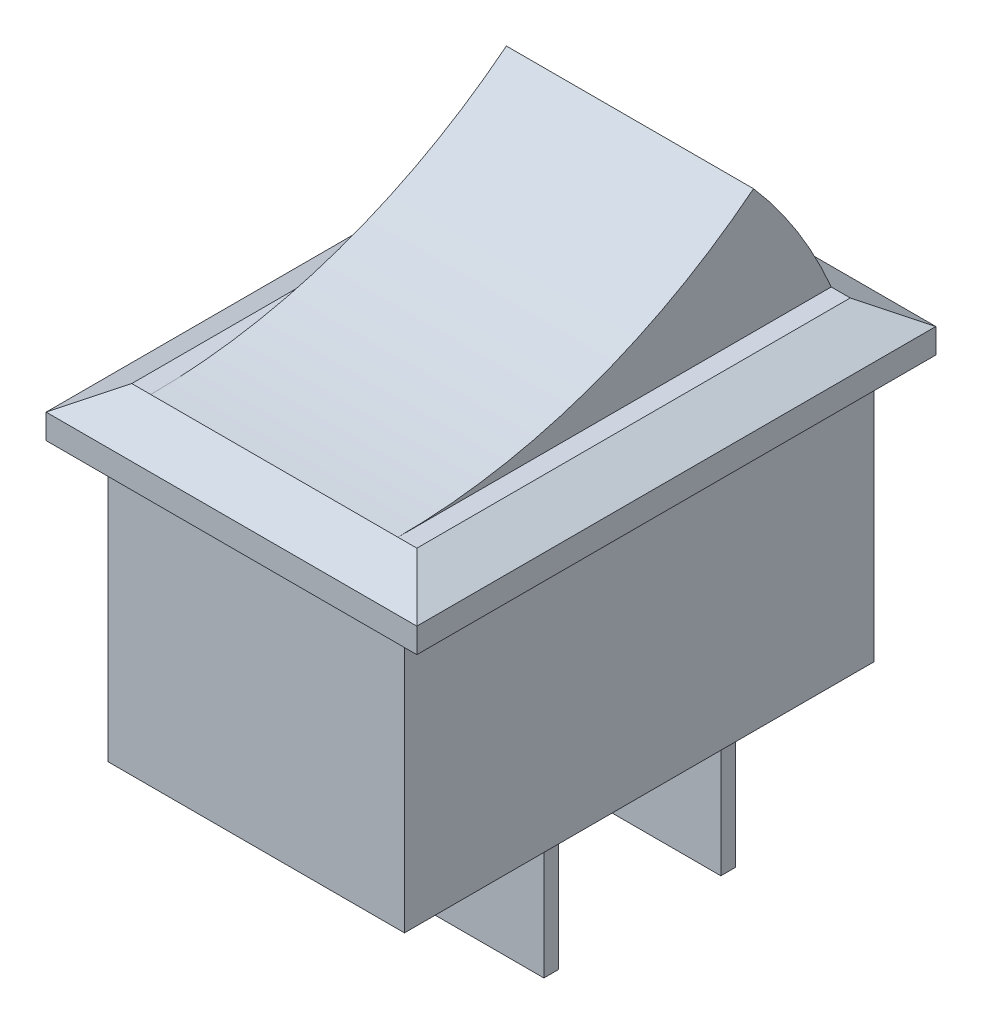
ISO-10303-21;
HEADER;
FILE_DESCRIPTION(('STEP AP214'),'2;1');
FILE_NAME('part.step','',(''),(''),'','','');
FILE_SCHEMA(('AUTOMOTIVE_DESIGN { 1 0 10303 214 1 1 1 1 }'));
ENDSEC;
DATA;
#1=APPLICATION_CONTEXT('core data for automotive mechanical design processes');
#2=APPLICATION_PROTOCOL_DEFINITION('international standard','automotive_design',2000,#1);
#3=PRODUCT_CONTEXT('',#1,'mechanical');
#4=PRODUCT('Part','Part','',(#3));
#5=PRODUCT_RELATED_PRODUCT_CATEGORY('part','',(#4));
#6=PRODUCT_DEFINITION_FORMATION('','',#4);
#7=PRODUCT_DEFINITION_CONTEXT('part definition',#1,'design');
#8=PRODUCT_DEFINITION('design','',#6,#7);
#9=PRODUCT_DEFINITION_SHAPE('','',#8);
#10=(LENGTH_UNIT() NAMED_UNIT(*) SI_UNIT(.MILLI.,.METRE.));
#11=(NAMED_UNIT(*) PLANE_ANGLE_UNIT() SI_UNIT($,.RADIAN.));
#12=(NAMED_UNIT(*) SI_UNIT($,.STERADIAN.) SOLID_ANGLE_UNIT());
#13=UNCERTAINTY_MEASURE_WITH_UNIT(LENGTH_MEASURE(1.E-05),#10,'distance_accuracy_value','');
#14=(GEOMETRIC_REPRESENTATION_CONTEXT(3) GLOBAL_UNCERTAINTY_ASSIGNED_CONTEXT((#13)) GLOBAL_UNIT_ASSIGNED_CONTEXT((#10,
#11,#12)) REPRESENTATION_CONTEXT('',''));
#15=CARTESIAN_POINT('',(0.,0.,0.));
#16=DIRECTION('',(0.,0.,1.));
#17=DIRECTION('',(1.,0.,0.));
#18=AXIS2_PLACEMENT_3D('',#15,#16,#17);
#19=CARTESIAN_POINT('',(0.,0.,0.));
#20=DIRECTION('',(0.,-1.,0.));
#21=DIRECTION('',(0.,0.,-1.));
#22=AXIS2_PLACEMENT_3D('',#19,#20,#21);
#23=PLANE('',#22);
#24=DIRECTION('',(0.,0.,-1.));
#25=VECTOR('',#24,1.);
#26=CARTESIAN_POINT('',(6.,0.,9.5));
#27=LINE('',#26,#25);
#28=CARTESIAN_POINT('',(6.,0.,9.5));
#29=VERTEX_POINT('',#28);
#30=CARTESIAN_POINT('',(6.,0.,-9.5));
#31=VERTEX_POINT('',#30);
#32=EDGE_CURVE('E330',#29,#31,#27,.T.);
#33=ORIENTED_EDGE('',*,*,#32,.F.);
#34=DIRECTION('',(1.,0.,0.));
#35=VECTOR('',#34,1.);
#36=CARTESIAN_POINT('',(-6.,0.,9.5));
#37=LINE('',#36,#35);
#38=CARTESIAN_POINT('',(-6.,0.,9.5));
#39=VERTEX_POINT('',#38);
#40=EDGE_CURVE('E335',#39,#29,#37,.T.);
#41=ORIENTED_EDGE('',*,*,#40,.F.);
#42=DIRECTION('',(0.,0.,1.));
#43=VECTOR('',#42,1.);
#44=CARTESIAN_POINT('',(-6.,0.,9.5));
#45=LINE('',#44,#43);
#46=CARTESIAN_POINT('',(-6.,0.,-9.5));
#47=VERTEX_POINT('',#46);
#48=EDGE_CURVE('E349',#47,#39,#45,.T.);
#49=ORIENTED_EDGE('',*,*,#48,.F.);
#50=DIRECTION('',(-1.,0.,0.));
#51=VECTOR('',#50,1.);
#52=CARTESIAN_POINT('',(-6.,0.,-9.5));
#53=LINE('',#52,#51);
#54=EDGE_CURVE('E347',#31,#47,#53,.T.);
#55=ORIENTED_EDGE('',*,*,#54,.F.);
#56=EDGE_LOOP('',(#33,#41,#49,#55));
#57=FACE_BOUND('',#56,.T.);
#58=DIRECTION('',(1.,0.,0.));
#59=VECTOR('',#58,1.);
#60=CARTESIAN_POINT('',(2.4,0.,-7.5));
#61=LINE('',#60,#59);
#62=CARTESIAN_POINT('',(-2.4,0.,-7.5));
#63=VERTEX_POINT('',#62);
#64=CARTESIAN_POINT('',(2.4,0.,-7.5));
#65=VERTEX_POINT('',#64);
#66=EDGE_CURVE('E232',#63,#65,#61,.T.);
#67=ORIENTED_EDGE('',*,*,#66,.F.);
#68=DIRECTION('',(0.,0.,-1.));
#69=VECTOR('',#68,1.);
#70=CARTESIAN_POINT('',(-2.4,0.,-7.5));
#71=LINE('',#70,#69);
#72=CARTESIAN_POINT('',(-2.4,0.,-6.9));
#73=VERTEX_POINT('',#72);
#74=EDGE_CURVE('E229',#73,#63,#71,.T.);
#75=ORIENTED_EDGE('',*,*,#74,.F.);
#76=DIRECTION('',(-1.,0.,0.));
#77=VECTOR('',#76,1.);
#78=CARTESIAN_POINT('',(2.4,0.,-6.9));
#79=LINE('',#78,#77);
#80=CARTESIAN_POINT('',(2.4,0.,-6.9));
#81=VERTEX_POINT('',#80);
#82=EDGE_CURVE('E241',#81,#73,#79,.T.);
#83=ORIENTED_EDGE('',*,*,#82,.F.);
#84=DIRECTION('',(0.,0.,1.));
#85=VECTOR('',#84,1.);
#86=CARTESIAN_POINT('',(2.4,0.,-7.5));
#87=LINE('',#86,#85);
#88=EDGE_CURVE('E249',#65,#81,#87,.T.);
#89=ORIENTED_EDGE('',*,*,#88,.F.);
#90=EDGE_LOOP('',(#67,#75,#83,#89));
#91=FACE_BOUND('',#90,.T.);
#92=DIRECTION('',(1.,0.,0.));
#93=VECTOR('',#92,1.);
#94=CARTESIAN_POINT('',(2.4,0.,-0.340000000000002));
#95=LINE('',#94,#93);
#96=CARTESIAN_POINT('',(-2.4,0.,-0.340000000000002));
#97=VERTEX_POINT('',#96);
#98=CARTESIAN_POINT('',(2.4,0.,-0.340000000000002));
#99=VERTEX_POINT('',#98);
#100=EDGE_CURVE('E786',#97,#99,#95,.T.);
#101=ORIENTED_EDGE('',*,*,#100,.F.);
#102=DIRECTION('',(0.,0.,-1.));
#103=VECTOR('',#102,1.);
#104=CARTESIAN_POINT('',(-2.4,0.,-0.340000000000002));
#105=LINE('',#104,#103);
#106=CARTESIAN_POINT('',(-2.4,0.,0.259999999999998));
#107=VERTEX_POINT('',#106);
#108=EDGE_CURVE('E227',#107,#97,#105,.T.);
#109=ORIENTED_EDGE('',*,*,#108,.F.);
#110=DIRECTION('',(-1.,0.,0.));
#111=VECTOR('',#110,1.);
#112=CARTESIAN_POINT('',(2.4,0.,0.259999999999998));
#113=LINE('',#112,#111);
#114=CARTESIAN_POINT('',(2.4,0.,0.259999999999998));
#115=VERTEX_POINT('',#114);
#116=EDGE_CURVE('E223',#115,#107,#113,.T.);
#117=ORIENTED_EDGE('',*,*,#116,.F.);
#118=DIRECTION('',(0.,0.,1.));
#119=VECTOR('',#118,1.);
#120=CARTESIAN_POINT('',(2.4,0.,-0.340000000000002));
#121=LINE('',#120,#119);
#122=EDGE_CURVE('E783',#99,#115,#121,.T.);
#123=ORIENTED_EDGE('',*,*,#122,.F.);
#124=EDGE_LOOP('',(#101,#109,#117,#123));
#125=FACE_BOUND('',#124,.T.);
#126=ADVANCED_FACE('F35',(#57,#91,#125),#23,.T.);
#127=CARTESIAN_POINT('',(0.,13.,0.));
#128=DIRECTION('',(0.,1.,0.));
#129=DIRECTION('',(0.,0.,1.));
#130=AXIS2_PLACEMENT_3D('',#127,#128,#129);
#131=PLANE('',#130);
#132=DIRECTION('',(-1.,0.,0.));
#133=VECTOR('',#132,1.);
#134=CARTESIAN_POINT('',(-7.5,13.,-8.76794919243113));
#135=LINE('',#134,#133);
#136=CARTESIAN_POINT('',(5.76794919243113,13.,-8.76794919243113));
#137=VERTEX_POINT('',#136);
#138=CARTESIAN_POINT('',(5.,13.,-8.76794919243113));
#139=VERTEX_POINT('',#138);
#140=EDGE_CURVE('E372',#137,#139,#135,.T.);
#141=ORIENTED_EDGE('',*,*,#140,.T.);
#142=DIRECTION('',(0.,0.,-1.));
#143=VECTOR('',#142,1.);
#144=CARTESIAN_POINT('',(5.,13.,8.));
#145=LINE('',#144,#143);
#146=CARTESIAN_POINT('',(5.,13.,8.76794919243113));
#147=VERTEX_POINT('',#146);
#148=EDGE_CURVE('E287',#147,#139,#145,.T.);
#149=ORIENTED_EDGE('',*,*,#148,.F.);
#150=DIRECTION('',(1.,0.,0.));
#151=VECTOR('',#150,1.);
#152=CARTESIAN_POINT('',(7.5,13.,8.76794919243113));
#153=LINE('',#152,#151);
#154=CARTESIAN_POINT('',(5.76794919243113,13.,8.76794919243113));
#155=VERTEX_POINT('',#154);
#156=EDGE_CURVE('E365',#147,#155,#153,.T.);
#157=ORIENTED_EDGE('',*,*,#156,.T.);
#158=DIRECTION('',(0.,0.,-1.));
#159=VECTOR('',#158,1.);
#160=CARTESIAN_POINT('',(5.76794919243113,13.,-10.5));
#161=LINE('',#160,#159);
#162=EDGE_CURVE('E363',#155,#137,#161,.T.);
#163=ORIENTED_EDGE('',*,*,#162,.T.);
#164=EDGE_LOOP('',(#141,#149,#157,#163));
#165=FACE_BOUND('',#164,.T.);
#166=ADVANCED_FACE('F449',(#165),#131,.T.);
#167=CARTESIAN_POINT('',(6.,11.,9.5));
#168=DIRECTION('',(-1.,0.,0.));
#169=DIRECTION('',(0.,0.,1.));
#170=AXIS2_PLACEMENT_3D('',#167,#168,#169);
#171=PLANE('',#170);
#172=ORIENTED_EDGE('',*,*,#32,.T.);
#173=DIRECTION('',(0.,-1.,0.));
#174=VECTOR('',#173,1.);
#175=CARTESIAN_POINT('',(6.,11.,-9.5));
#176=LINE('',#175,#174);
#177=CARTESIAN_POINT('',(6.,11.,-9.5));
#178=VERTEX_POINT('',#177);
#179=EDGE_CURVE('E360',#178,#31,#176,.T.);
#180=ORIENTED_EDGE('',*,*,#179,.F.);
#181=DIRECTION('',(0.,0.,-1.));
#182=VECTOR('',#181,1.);
#183=CARTESIAN_POINT('',(6.,11.,9.5));
#184=LINE('',#183,#182);
#185=CARTESIAN_POINT('',(6.,11.,9.5));
#186=VERTEX_POINT('',#185);
#187=EDGE_CURVE('E331',#186,#178,#184,.T.);
#188=ORIENTED_EDGE('',*,*,#187,.F.);
#189=DIRECTION('',(0.,-1.,0.));
#190=VECTOR('',#189,1.);
#191=CARTESIAN_POINT('',(6.,11.,9.5));
#192=LINE('',#191,#190);
#193=EDGE_CURVE('E344',#186,#29,#192,.T.);
#194=ORIENTED_EDGE('',*,*,#193,.T.);
#195=EDGE_LOOP('',(#172,#180,#188,#194));
#196=FACE_BOUND('',#195,.T.);
#197=ADVANCED_FACE('F451',(#196),#171,.F.);
#198=CARTESIAN_POINT('',(-6.,11.,-9.5));
#199=DIRECTION('',(0.,0.,1.));
#200=DIRECTION('',(1.,0.,0.));
#201=AXIS2_PLACEMENT_3D('',#198,#199,#200);
#202=PLANE('',#201);
#203=ORIENTED_EDGE('',*,*,#54,.T.);
#204=DIRECTION('',(0.,-1.,0.));
#205=VECTOR('',#204,1.);
#206=CARTESIAN_POINT('',(-6.,11.,-9.5));
#207=LINE('',#206,#205);
#208=CARTESIAN_POINT('',(-6.,11.,-9.5));
#209=VERTEX_POINT('',#208);
#210=EDGE_CURVE('E357',#209,#47,#207,.T.);
#211=ORIENTED_EDGE('',*,*,#210,.F.);
#212=DIRECTION('',(-1.,0.,0.));
#213=VECTOR('',#212,1.);
#214=CARTESIAN_POINT('',(-6.,11.,-9.5));
#215=LINE('',#214,#213);
#216=EDGE_CURVE('E334',#178,#209,#215,.T.);
#217=ORIENTED_EDGE('',*,*,#216,.F.);
#218=ORIENTED_EDGE('',*,*,#179,.T.);
#219=EDGE_LOOP('',(#203,#211,#217,#218));
#220=FACE_BOUND('',#219,.T.);
#221=ADVANCED_FACE('F457',(#220),#202,.F.);
#222=CARTESIAN_POINT('',(-6.,11.,9.5));
#223=DIRECTION('',(1.,0.,0.));
#224=DIRECTION('',(0.,0.,-1.));
#225=AXIS2_PLACEMENT_3D('',#222,#223,#224);
#226=PLANE('',#225);
#227=ORIENTED_EDGE('',*,*,#48,.T.);
#228=DIRECTION('',(0.,-1.,0.));
#229=VECTOR('',#228,1.);
#230=CARTESIAN_POINT('',(-6.,11.,9.5));
#231=LINE('',#230,#229);
#232=CARTESIAN_POINT('',(-6.,11.,9.5));
#233=VERTEX_POINT('',#232);
#234=EDGE_CURVE('E354',#233,#39,#231,.T.);
#235=ORIENTED_EDGE('',*,*,#234,.F.);
#236=DIRECTION('',(0.,0.,1.));
#237=VECTOR('',#236,1.);
#238=CARTESIAN_POINT('',(-6.,11.,9.5));
#239=LINE('',#238,#237);
#240=EDGE_CURVE('E338',#209,#233,#239,.T.);
#241=ORIENTED_EDGE('',*,*,#240,.F.);
#242=ORIENTED_EDGE('',*,*,#210,.T.);
#243=EDGE_LOOP('',(#227,#235,#241,#242));
#244=FACE_BOUND('',#243,.T.);
#245=ADVANCED_FACE('F474',(#244),#226,.F.);
#246=CARTESIAN_POINT('',(-6.,11.,9.5));
#247=DIRECTION('',(0.,0.,-1.));
#248=DIRECTION('',(-1.,0.,0.));
#249=AXIS2_PLACEMENT_3D('',#246,#247,#248);
#250=PLANE('',#249);
#251=ORIENTED_EDGE('',*,*,#40,.T.);
#252=ORIENTED_EDGE('',*,*,#193,.F.);
#253=DIRECTION('',(1.,0.,0.));
#254=VECTOR('',#253,1.);
#255=CARTESIAN_POINT('',(-6.,11.,9.5));
#256=LINE('',#255,#254);
#257=EDGE_CURVE('E341',#233,#186,#256,.T.);
#258=ORIENTED_EDGE('',*,*,#257,.F.);
#259=ORIENTED_EDGE('',*,*,#234,.T.);
#260=EDGE_LOOP('',(#251,#252,#258,#259));
#261=FACE_BOUND('',#260,.T.);
#262=ADVANCED_FACE('F470',(#261),#250,.F.);
#263=CARTESIAN_POINT('',(0.,11.,0.));
#264=DIRECTION('',(0.,1.,0.));
#265=DIRECTION('',(0.,0.,1.));
#266=AXIS2_PLACEMENT_3D('',#263,#264,#265);
#267=PLANE('',#266);
#268=DIRECTION('',(0.,0.,1.));
#269=VECTOR('',#268,1.);
#270=CARTESIAN_POINT('',(-7.5,11.,10.5));
#271=LINE('',#270,#269);
#272=CARTESIAN_POINT('',(-7.5,11.,-10.5));
#273=VERTEX_POINT('',#272);
#274=CARTESIAN_POINT('',(-7.5,11.,10.5));
#275=VERTEX_POINT('',#274);
#276=EDGE_CURVE('E310',#273,#275,#271,.T.);
#277=ORIENTED_EDGE('',*,*,#276,.F.);
#278=DIRECTION('',(-1.,0.,0.));
#279=VECTOR('',#278,1.);
#280=CARTESIAN_POINT('',(7.5,11.,-10.5));
#281=LINE('',#280,#279);
#282=CARTESIAN_POINT('',(7.5,11.,-10.5));
#283=VERTEX_POINT('',#282);
#284=EDGE_CURVE('E319',#283,#273,#281,.T.);
#285=ORIENTED_EDGE('',*,*,#284,.F.);
#286=DIRECTION('',(0.,0.,-1.));
#287=VECTOR('',#286,1.);
#288=CARTESIAN_POINT('',(7.5,11.,10.5));
#289=LINE('',#288,#287);
#290=CARTESIAN_POINT('',(7.5,11.,10.5));
#291=VERTEX_POINT('',#290);
#292=EDGE_CURVE('E316',#291,#283,#289,.T.);
#293=ORIENTED_EDGE('',*,*,#292,.F.);
#294=DIRECTION('',(1.,0.,0.));
#295=VECTOR('',#294,1.);
#296=CARTESIAN_POINT('',(7.5,11.,10.5));
#297=LINE('',#296,#295);
#298=EDGE_CURVE('E313',#275,#291,#297,.T.);
#299=ORIENTED_EDGE('',*,*,#298,.F.);
#300=EDGE_LOOP('',(#277,#285,#293,#299));
#301=FACE_BOUND('',#300,.T.);
#302=ORIENTED_EDGE('',*,*,#257,.T.);
#303=ORIENTED_EDGE('',*,*,#187,.T.);
#304=ORIENTED_EDGE('',*,*,#216,.T.);
#305=ORIENTED_EDGE('',*,*,#240,.T.);
#306=EDGE_LOOP('',(#302,#303,#304,#305));
#307=FACE_BOUND('',#306,.T.);
#308=ADVANCED_FACE('F415',(#301,#307),#267,.F.);
#309=DIRECTION('',(0.,0.,1.));
#310=VECTOR('',#309,1.);
#311=CARTESIAN_POINT('',(-5.,13.,8.));
#312=LINE('',#311,#310);
#313=CARTESIAN_POINT('',(-5.,13.,-8.76794919243113));
#314=VERTEX_POINT('',#313);
#315=CARTESIAN_POINT('',(-5.,13.,8.76794919243113));
#316=VERTEX_POINT('',#315);
#317=EDGE_CURVE('E285',#314,#316,#312,.T.);
#318=ORIENTED_EDGE('',*,*,#317,.F.);
#319=CARTESIAN_POINT('',(-5.76794919243113,13.,-8.76794919243113));
#320=VERTEX_POINT('',#319);
#321=EDGE_CURVE('E371',#314,#320,#135,.T.);
#322=ORIENTED_EDGE('',*,*,#321,.T.);
#323=DIRECTION('',(0.,0.,1.));
#324=VECTOR('',#323,1.);
#325=CARTESIAN_POINT('',(-5.76794919243113,13.,10.5));
#326=LINE('',#325,#324);
#327=CARTESIAN_POINT('',(-5.76794919243113,13.,8.76794919243113));
#328=VERTEX_POINT('',#327);
#329=EDGE_CURVE('E369',#320,#328,#326,.T.);
#330=ORIENTED_EDGE('',*,*,#329,.T.);
#331=EDGE_CURVE('E366',#328,#316,#153,.T.);
#332=ORIENTED_EDGE('',*,*,#331,.T.);
#333=EDGE_LOOP('',(#318,#322,#330,#332));
#334=FACE_BOUND('',#333,.T.);
#335=ADVANCED_FACE('F433',(#334),#131,.T.);
#336=CARTESIAN_POINT('',(-7.5,13.,10.5));
#337=DIRECTION('',(1.,0.,0.));
#338=DIRECTION('',(0.,0.,-1.));
#339=AXIS2_PLACEMENT_3D('',#336,#337,#338);
#340=PLANE('',#339);
#341=DIRECTION('',(0.,-1.,0.));
#342=VECTOR('',#341,1.);
#343=CARTESIAN_POINT('',(-7.5,13.,10.5));
#344=LINE('',#343,#342);
#345=CARTESIAN_POINT('',(-7.5,12.,10.5));
#346=VERTEX_POINT('',#345);
#347=EDGE_CURVE('E328',#346,#275,#344,.T.);
#348=ORIENTED_EDGE('',*,*,#347,.F.);
#349=DIRECTION('',(0.,0.,-1.));
#350=VECTOR('',#349,1.);
#351=CARTESIAN_POINT('',(-7.5,12.,-10.5));
#352=LINE('',#351,#350);
#353=CARTESIAN_POINT('',(-7.5,12.,-10.5));
#354=VERTEX_POINT('',#353);
#355=EDGE_CURVE('E379',#346,#354,#352,.T.);
#356=ORIENTED_EDGE('',*,*,#355,.T.);
#357=DIRECTION('',(0.,-1.,0.));
#358=VECTOR('',#357,1.);
#359=CARTESIAN_POINT('',(-7.5,13.,-10.5));
#360=LINE('',#359,#358);
#361=EDGE_CURVE('E322',#354,#273,#360,.T.);
#362=ORIENTED_EDGE('',*,*,#361,.T.);
#363=ORIENTED_EDGE('',*,*,#276,.T.);
#364=EDGE_LOOP('',(#348,#356,#362,#363));
#365=FACE_BOUND('',#364,.T.);
#366=ADVANCED_FACE('F410',(#365),#340,.F.);
#367=CARTESIAN_POINT('',(7.5,13.,10.5));
#368=DIRECTION('',(0.,0.,-1.));
#369=DIRECTION('',(-1.,0.,0.));
#370=AXIS2_PLACEMENT_3D('',#367,#368,#369);
#371=PLANE('',#370);
#372=DIRECTION('',(0.,-1.,0.));
#373=VECTOR('',#372,1.);
#374=CARTESIAN_POINT('',(7.5,13.,10.5));
#375=LINE('',#374,#373);
#376=CARTESIAN_POINT('',(7.5,12.,10.5));
#377=VERTEX_POINT('',#376);
#378=EDGE_CURVE('E326',#377,#291,#375,.T.);
#379=ORIENTED_EDGE('',*,*,#378,.F.);
#380=DIRECTION('',(-1.,0.,0.));
#381=VECTOR('',#380,1.);
#382=CARTESIAN_POINT('',(-7.5,12.,10.5));
#383=LINE('',#382,#381);
#384=EDGE_CURVE('E381',#377,#346,#383,.T.);
#385=ORIENTED_EDGE('',*,*,#384,.T.);
#386=ORIENTED_EDGE('',*,*,#347,.T.);
#387=ORIENTED_EDGE('',*,*,#298,.T.);
#388=EDGE_LOOP('',(#379,#385,#386,#387));
#389=FACE_BOUND('',#388,.T.);
#390=ADVANCED_FACE('F407',(#389),#371,.F.);
#391=CARTESIAN_POINT('',(7.5,13.,10.5));
#392=DIRECTION('',(-1.,0.,0.));
#393=DIRECTION('',(0.,0.,1.));
#394=AXIS2_PLACEMENT_3D('',#391,#392,#393);
#395=PLANE('',#394);
#396=DIRECTION('',(0.,-1.,0.));
#397=VECTOR('',#396,1.);
#398=CARTESIAN_POINT('',(7.5,13.,-10.5));
#399=LINE('',#398,#397);
#400=CARTESIAN_POINT('',(7.5,12.,-10.5));
#401=VERTEX_POINT('',#400);
#402=EDGE_CURVE('E324',#401,#283,#399,.T.);
#403=ORIENTED_EDGE('',*,*,#402,.F.);
#404=DIRECTION('',(0.,0.,1.));
#405=VECTOR('',#404,1.);
#406=CARTESIAN_POINT('',(7.5,12.,10.5));
#407=LINE('',#406,#405);
#408=EDGE_CURVE('E44',#401,#377,#407,.T.);
#409=ORIENTED_EDGE('',*,*,#408,.T.);
#410=ORIENTED_EDGE('',*,*,#378,.T.);
#411=ORIENTED_EDGE('',*,*,#292,.T.);
#412=EDGE_LOOP('',(#403,#409,#410,#411));
#413=FACE_BOUND('',#412,.T.);
#414=ADVANCED_FACE('F420',(#413),#395,.F.);
#415=CARTESIAN_POINT('',(7.5,13.,-10.5));
#416=DIRECTION('',(0.,0.,1.));
#417=DIRECTION('',(1.,0.,0.));
#418=AXIS2_PLACEMENT_3D('',#415,#416,#417);
#419=PLANE('',#418);
#420=ORIENTED_EDGE('',*,*,#361,.F.);
#421=DIRECTION('',(1.,0.,0.));
#422=VECTOR('',#421,1.);
#423=CARTESIAN_POINT('',(7.5,12.,-10.5));
#424=LINE('',#423,#422);
#425=EDGE_CURVE('E375',#354,#401,#424,.T.);
#426=ORIENTED_EDGE('',*,*,#425,.T.);
#427=ORIENTED_EDGE('',*,*,#402,.T.);
#428=ORIENTED_EDGE('',*,*,#284,.T.);
#429=EDGE_LOOP('',(#420,#426,#427,#428));
#430=FACE_BOUND('',#429,.T.);
#431=ADVANCED_FACE('F422',(#430),#419,.F.);
#432=CARTESIAN_POINT('',(0.,13.,8.76794919243113));
#433=DIRECTION('',(0.,0.866025403784438,0.500000000000002));
#434=DIRECTION('',(-1.,0.,0.));
#435=AXIS2_PLACEMENT_3D('',#432,#433,#434);
#436=PLANE('',#435);
#437=DIRECTION('',(-0.654653670707977,-0.377964473009229,0.654653670707977));
#438=VECTOR('',#437,1.);
#439=CARTESIAN_POINT('',(-3.2959709671035,14.4271972938238,6.29597096710351));
#440=LINE('',#439,#438);
#441=EDGE_CURVE('E388',#346,#328,#440,.F.);
#442=ORIENTED_EDGE('',*,*,#441,.F.);
#443=ORIENTED_EDGE('',*,*,#384,.F.);
#444=DIRECTION('',(0.654653670707977,-0.377964473009229,0.654653670707977));
#445=VECTOR('',#444,1.);
#446=CARTESIAN_POINT('',(2.01025668138923,15.1695047827819,5.01025668138922));
#447=LINE('',#446,#445);
#448=EDGE_CURVE('E295',#155,#377,#447,.T.);
#449=ORIENTED_EDGE('',*,*,#448,.F.);
#450=ORIENTED_EDGE('',*,*,#156,.F.);
#451=DIRECTION('',(-1.,0.,0.));
#452=VECTOR('',#451,1.);
#453=CARTESIAN_POINT('',(23.9133652390862,13.,8.76794919243113));
#454=LINE('',#453,#452);
#455=EDGE_CURVE('E275',#147,#316,#454,.T.);
#456=ORIENTED_EDGE('',*,*,#455,.T.);
#457=ORIENTED_EDGE('',*,*,#331,.F.);
#458=EDGE_LOOP('',(#442,#443,#449,#450,#456,#457));
#459=FACE_BOUND('',#458,.T.);
#460=ADVANCED_FACE('F37',(#459),#436,.T.);
#461=CARTESIAN_POINT('',(5.76794919243113,13.,0.));
#462=DIRECTION('',(0.500000000000002,0.866025403784438,0.));
#463=DIRECTION('',(0.,0.,1.));
#464=AXIS2_PLACEMENT_3D('',#461,#462,#463);
#465=PLANE('',#464);
#466=ORIENTED_EDGE('',*,*,#448,.T.);
#467=ORIENTED_EDGE('',*,*,#408,.F.);
#468=DIRECTION('',(-0.654653670707977,0.377964473009229,0.654653670707977));
#469=VECTOR('',#468,1.);
#470=CARTESIAN_POINT('',(2.01025668138922,15.1695047827819,-5.01025668138922));
#471=LINE('',#470,#469);
#472=EDGE_CURVE('E386',#137,#401,#471,.F.);
#473=ORIENTED_EDGE('',*,*,#472,.F.);
#474=ORIENTED_EDGE('',*,*,#162,.F.);
#475=EDGE_LOOP('',(#466,#467,#473,#474));
#476=FACE_BOUND('',#475,.T.);
#477=ADVANCED_FACE('F395',(#476),#465,.T.);
#478=CARTESIAN_POINT('',(-5.76794919243113,13.,0.));
#479=DIRECTION('',(-0.500000000000002,0.866025403784438,0.));
#480=DIRECTION('',(0.,0.,-1.));
#481=AXIS2_PLACEMENT_3D('',#478,#479,#480);
#482=PLANE('',#481);
#483=ORIENTED_EDGE('',*,*,#441,.T.);
#484=ORIENTED_EDGE('',*,*,#329,.F.);
#485=DIRECTION('',(-0.654653670707977,-0.377964473009229,-0.654653670707977));
#486=VECTOR('',#485,1.);
#487=CARTESIAN_POINT('',(-2.01025668138922,15.1695047827819,-5.01025668138922));
#488=LINE('',#487,#486);
#489=EDGE_CURVE('E284',#354,#320,#488,.F.);
#490=ORIENTED_EDGE('',*,*,#489,.F.);
#491=ORIENTED_EDGE('',*,*,#355,.F.);
#492=EDGE_LOOP('',(#483,#484,#490,#491));
#493=FACE_BOUND('',#492,.T.);
#494=ADVANCED_FACE('F431',(#493),#482,.T.);
#495=CARTESIAN_POINT('',(0.,13.,-8.76794919243113));
#496=DIRECTION('',(0.,0.866025403784438,-0.500000000000002));
#497=DIRECTION('',(1.,0.,0.));
#498=AXIS2_PLACEMENT_3D('',#495,#496,#497);
#499=PLANE('',#498);
#500=ORIENTED_EDGE('',*,*,#472,.T.);
#501=ORIENTED_EDGE('',*,*,#425,.F.);
#502=ORIENTED_EDGE('',*,*,#489,.T.);
#503=ORIENTED_EDGE('',*,*,#321,.F.);
#504=EDGE_CURVE('E376',#139,#314,#135,.T.);
#505=ORIENTED_EDGE('',*,*,#504,.F.);
#506=ORIENTED_EDGE('',*,*,#140,.F.);
#507=EDGE_LOOP('',(#500,#501,#502,#503,#505,#506));
#508=FACE_BOUND('',#507,.T.);
#509=ADVANCED_FACE('F426',(#508),#499,.T.);
#510=CARTESIAN_POINT('',(23.9133652390862,5.5,8.76794919243113));
#511=DIRECTION('',(-1.,0.,0.));
#512=DIRECTION('',(0.,0.,1.));
#513=AXIS2_PLACEMENT_3D('',#510,#511,#512);
#514=CYLINDRICAL_SURFACE('',#513,19.072433829069);
#515=ORIENTED_EDGE('',*,*,#504,.T.);
#516=CARTESIAN_POINT('',(-5.,5.5,8.76794919243113));
#517=DIRECTION('',(1.,0.,0.));
#518=DIRECTION('',(0.,0.,1.));
#519=AXIS2_PLACEMENT_3D('',#516,#517,#518);
#520=CIRCLE('',#519,19.072433829069);
#521=CARTESIAN_POINT('',(-5.,18.0172794934971,-5.62216707693558));
#522=VERTEX_POINT('',#521);
#523=EDGE_CURVE('E260',#314,#522,#520,.T.);
#524=ORIENTED_EDGE('',*,*,#523,.T.);
#525=DIRECTION('',(-1.,0.,0.));
#526=VECTOR('',#525,1.);
#527=CARTESIAN_POINT('',(23.9133652390862,18.0172794934971,-5.62216707693558));
#528=LINE('',#527,#526);
#529=CARTESIAN_POINT('',(5.,18.0172794934971,-5.62216707693558));
#530=VERTEX_POINT('',#529);
#531=EDGE_CURVE('E278',#530,#522,#528,.T.);
#532=ORIENTED_EDGE('',*,*,#531,.F.);
#533=CARTESIAN_POINT('',(5.,5.5,8.76794919243113));
#534=DIRECTION('',(-1.,0.,0.));
#535=DIRECTION('',(0.,0.,1.));
#536=AXIS2_PLACEMENT_3D('',#533,#534,#535);
#537=CIRCLE('',#536,19.072433829069);
#538=EDGE_CURVE('E264',#530,#139,#537,.T.);
#539=ORIENTED_EDGE('',*,*,#538,.T.);
#540=EDGE_LOOP('',(#515,#524,#532,#539));
#541=FACE_BOUND('',#540,.T.);
#542=ADVANCED_FACE('F445',(#541),#514,.T.);
#543=CARTESIAN_POINT('',(23.9133652390862,36.144867658138,8.76794919243113));
#544=DIRECTION('',(-1.,0.,0.));
#545=DIRECTION('',(0.,0.,1.));
#546=AXIS2_PLACEMENT_3D('',#543,#544,#545);
#547=CYLINDRICAL_SURFACE('',#546,23.144867658138);
#548=ORIENTED_EDGE('',*,*,#455,.F.);
#549=CARTESIAN_POINT('',(5.,36.144867658138,8.76794919243113));
#550=DIRECTION('',(-1.,0.,0.));
#551=DIRECTION('',(0.,0.,1.));
#552=AXIS2_PLACEMENT_3D('',#549,#550,#551);
#553=CIRCLE('',#552,23.144867658138);
#554=EDGE_CURVE('E261',#147,#530,#553,.F.);
#555=ORIENTED_EDGE('',*,*,#554,.T.);
#556=ORIENTED_EDGE('',*,*,#531,.T.);
#557=CARTESIAN_POINT('',(-5.,36.144867658138,8.76794919243113));
#558=DIRECTION('',(-1.,0.,0.));
#559=DIRECTION('',(0.,0.,1.));
#560=AXIS2_PLACEMENT_3D('',#557,#558,#559);
#561=CIRCLE('',#560,23.144867658138);
#562=EDGE_CURVE('E270',#522,#316,#561,.T.);
#563=ORIENTED_EDGE('',*,*,#562,.T.);
#564=EDGE_LOOP('',(#548,#555,#556,#563));
#565=FACE_BOUND('',#564,.T.);
#566=ADVANCED_FACE('F436',(#565),#547,.F.);
#567=CARTESIAN_POINT('',(5.,13.,8.));
#568=DIRECTION('',(-1.,0.,0.));
#569=DIRECTION('',(0.,0.,1.));
#570=AXIS2_PLACEMENT_3D('',#567,#568,#569);
#571=PLANE('',#570);
#572=ORIENTED_EDGE('',*,*,#148,.T.);
#573=ORIENTED_EDGE('',*,*,#538,.F.);
#574=ORIENTED_EDGE('',*,*,#554,.F.);
#575=EDGE_LOOP('',(#572,#573,#574));
#576=FACE_BOUND('',#575,.T.);
#577=ADVANCED_FACE('F447',(#576),#571,.F.);
#578=CARTESIAN_POINT('',(-5.,5.5,8.76794919243113));
#579=DIRECTION('',(-1.,0.,0.));
#580=DIRECTION('',(0.,0.,1.));
#581=AXIS2_PLACEMENT_3D('',#578,#579,#580);
#582=PLANE('',#581);
#583=ORIENTED_EDGE('',*,*,#523,.F.);
#584=ORIENTED_EDGE('',*,*,#317,.T.);
#585=ORIENTED_EDGE('',*,*,#562,.F.);
#586=EDGE_LOOP('',(#583,#584,#585));
#587=FACE_BOUND('',#586,.T.);
#588=ADVANCED_FACE('F441',(#587),#582,.T.);
#589=CARTESIAN_POINT('',(-2.4,-8.,-7.5));
#590=DIRECTION('',(1.,0.,0.));
#591=DIRECTION('',(0.,0.,-1.));
#592=AXIS2_PLACEMENT_3D('',#589,#590,#591);
#593=PLANE('',#592);
#594=ORIENTED_EDGE('',*,*,#74,.T.);
#595=DIRECTION('',(0.,1.,0.));
#596=VECTOR('',#595,1.);
#597=CARTESIAN_POINT('',(-2.4,-8.,-7.5));
#598=LINE('',#597,#596);
#599=CARTESIAN_POINT('',(-2.4,-8.,-7.5));
#600=VERTEX_POINT('',#599);
#601=EDGE_CURVE('E258',#600,#63,#598,.T.);
#602=ORIENTED_EDGE('',*,*,#601,.F.);
#603=DIRECTION('',(0.,0.,-1.));
#604=VECTOR('',#603,1.);
#605=CARTESIAN_POINT('',(-2.4,-8.,-7.5));
#606=LINE('',#605,#604);
#607=CARTESIAN_POINT('',(-2.4,-8.,-6.9));
#608=VERTEX_POINT('',#607);
#609=EDGE_CURVE('E237',#608,#600,#606,.T.);
#610=ORIENTED_EDGE('',*,*,#609,.F.);
#611=DIRECTION('',(0.,1.,0.));
#612=VECTOR('',#611,1.);
#613=CARTESIAN_POINT('',(-2.4,-8.,-6.9));
#614=LINE('',#613,#612);
#615=EDGE_CURVE('E246',#608,#73,#614,.T.);
#616=ORIENTED_EDGE('',*,*,#615,.T.);
#617=EDGE_LOOP('',(#594,#602,#610,#616));
#618=FACE_BOUND('',#617,.T.);
#619=ADVANCED_FACE('F614',(#618),#593,.F.);
#620=CARTESIAN_POINT('',(2.4,-8.,-7.5));
#621=DIRECTION('',(0.,0.,1.));
#622=DIRECTION('',(1.,0.,0.));
#623=AXIS2_PLACEMENT_3D('',#620,#621,#622);
#624=PLANE('',#623);
#625=ORIENTED_EDGE('',*,*,#66,.T.);
#626=DIRECTION('',(0.,1.,0.));
#627=VECTOR('',#626,1.);
#628=CARTESIAN_POINT('',(2.4,-8.,-7.5));
#629=LINE('',#628,#627);
#630=CARTESIAN_POINT('',(2.4,-8.,-7.5));
#631=VERTEX_POINT('',#630);
#632=EDGE_CURVE('E255',#631,#65,#629,.T.);
#633=ORIENTED_EDGE('',*,*,#632,.F.);
#634=DIRECTION('',(1.,0.,0.));
#635=VECTOR('',#634,1.);
#636=CARTESIAN_POINT('',(2.4,-8.,-7.5));
#637=LINE('',#636,#635);
#638=EDGE_CURVE('E240',#600,#631,#637,.T.);
#639=ORIENTED_EDGE('',*,*,#638,.F.);
#640=ORIENTED_EDGE('',*,*,#601,.T.);
#641=EDGE_LOOP('',(#625,#633,#639,#640));
#642=FACE_BOUND('',#641,.T.);
#643=ADVANCED_FACE('F622',(#642),#624,.F.);
#644=CARTESIAN_POINT('',(2.4,-8.,-7.5));
#645=DIRECTION('',(-1.,0.,0.));
#646=DIRECTION('',(0.,0.,1.));
#647=AXIS2_PLACEMENT_3D('',#644,#645,#646);
#648=PLANE('',#647);
#649=ORIENTED_EDGE('',*,*,#88,.T.);
#650=DIRECTION('',(0.,1.,0.));
#651=VECTOR('',#650,1.);
#652=CARTESIAN_POINT('',(2.4,-8.,-6.9));
#653=LINE('',#652,#651);
#654=CARTESIAN_POINT('',(2.4,-8.,-6.9));
#655=VERTEX_POINT('',#654);
#656=EDGE_CURVE('E59',#655,#81,#653,.T.);
#657=ORIENTED_EDGE('',*,*,#656,.F.);
#658=DIRECTION('',(0.,0.,1.));
#659=VECTOR('',#658,1.);
#660=CARTESIAN_POINT('',(2.4,-8.,-7.5));
#661=LINE('',#660,#659);
#662=EDGE_CURVE('E243',#631,#655,#661,.T.);
#663=ORIENTED_EDGE('',*,*,#662,.F.);
#664=ORIENTED_EDGE('',*,*,#632,.T.);
#665=EDGE_LOOP('',(#649,#657,#663,#664));
#666=FACE_BOUND('',#665,.T.);
#667=ADVANCED_FACE('F631',(#666),#648,.F.);
#668=CARTESIAN_POINT('',(2.4,-8.,-6.9));
#669=DIRECTION('',(0.,0.,-1.));
#670=DIRECTION('',(-1.,0.,0.));
#671=AXIS2_PLACEMENT_3D('',#668,#669,#670);
#672=PLANE('',#671);
#673=ORIENTED_EDGE('',*,*,#82,.T.);
#674=ORIENTED_EDGE('',*,*,#615,.F.);
#675=DIRECTION('',(-1.,0.,0.));
#676=VECTOR('',#675,1.);
#677=CARTESIAN_POINT('',(2.4,-8.,-6.9));
#678=LINE('',#677,#676);
#679=EDGE_CURVE('E245',#655,#608,#678,.T.);
#680=ORIENTED_EDGE('',*,*,#679,.F.);
#681=ORIENTED_EDGE('',*,*,#656,.T.);
#682=EDGE_LOOP('',(#673,#674,#680,#681));
#683=FACE_BOUND('',#682,.T.);
#684=ADVANCED_FACE('F639',(#683),#672,.F.);
#685=CARTESIAN_POINT('',(0.,-8.,0.));
#686=DIRECTION('',(0.,-1.,0.));
#687=DIRECTION('',(0.,0.,-1.));
#688=AXIS2_PLACEMENT_3D('',#685,#686,#687);
#689=PLANE('',#688);
#690=ORIENTED_EDGE('',*,*,#609,.T.);
#691=ORIENTED_EDGE('',*,*,#638,.T.);
#692=ORIENTED_EDGE('',*,*,#662,.T.);
#693=ORIENTED_EDGE('',*,*,#679,.T.);
#694=EDGE_LOOP('',(#690,#691,#692,#693));
#695=FACE_BOUND('',#694,.T.);
#696=ADVANCED_FACE('F647',(#695),#689,.T.);
#697=CARTESIAN_POINT('',(-2.4,-8.,-0.340000000000002));
#698=DIRECTION('',(1.,0.,0.));
#699=DIRECTION('',(0.,0.,-1.));
#700=AXIS2_PLACEMENT_3D('',#697,#698,#699);
#701=PLANE('',#700);
#702=ORIENTED_EDGE('',*,*,#108,.T.);
#703=DIRECTION('',(0.,1.,0.));
#704=VECTOR('',#703,1.);
#705=CARTESIAN_POINT('',(-2.4,-8.,-0.340000000000002));
#706=LINE('',#705,#704);
#707=CARTESIAN_POINT('',(-2.4,-8.,-0.340000000000002));
#708=VERTEX_POINT('',#707);
#709=EDGE_CURVE('E208',#708,#97,#706,.T.);
#710=ORIENTED_EDGE('',*,*,#709,.F.);
#711=DIRECTION('',(0.,0.,-1.));
#712=VECTOR('',#711,1.);
#713=CARTESIAN_POINT('',(-2.4,-8.,-0.340000000000002));
#714=LINE('',#713,#712);
#715=CARTESIAN_POINT('',(-2.4,-8.,0.259999999999998));
#716=VERTEX_POINT('',#715);
#717=EDGE_CURVE('E215',#716,#708,#714,.T.);
#718=ORIENTED_EDGE('',*,*,#717,.F.);
#719=DIRECTION('',(0.,1.,0.));
#720=VECTOR('',#719,1.);
#721=CARTESIAN_POINT('',(-2.4,-8.,0.259999999999998));
#722=LINE('',#721,#720);
#723=EDGE_CURVE('E780',#716,#107,#722,.T.);
#724=ORIENTED_EDGE('',*,*,#723,.T.);
#725=EDGE_LOOP('',(#702,#710,#718,#724));
#726=FACE_BOUND('',#725,.T.);
#727=ADVANCED_FACE('F225',(#726),#701,.F.);
#728=CARTESIAN_POINT('',(2.4,-8.,-0.340000000000002));
#729=DIRECTION('',(0.,0.,1.));
#730=DIRECTION('',(1.,0.,0.));
#731=AXIS2_PLACEMENT_3D('',#728,#729,#730);
#732=PLANE('',#731);
#733=ORIENTED_EDGE('',*,*,#100,.T.);
#734=DIRECTION('',(0.,1.,0.));
#735=VECTOR('',#734,1.);
#736=CARTESIAN_POINT('',(2.4,-8.,-0.340000000000002));
#737=LINE('',#736,#735);
#738=CARTESIAN_POINT('',(2.4,-8.,-0.340000000000002));
#739=VERTEX_POINT('',#738);
#740=EDGE_CURVE('E211',#739,#99,#737,.T.);
#741=ORIENTED_EDGE('',*,*,#740,.F.);
#742=DIRECTION('',(1.,0.,0.));
#743=VECTOR('',#742,1.);
#744=CARTESIAN_POINT('',(2.4,-8.,-0.340000000000002));
#745=LINE('',#744,#743);
#746=EDGE_CURVE('E204',#708,#739,#745,.T.);
#747=ORIENTED_EDGE('',*,*,#746,.F.);
#748=ORIENTED_EDGE('',*,*,#709,.T.);
#749=EDGE_LOOP('',(#733,#741,#747,#748));
#750=FACE_BOUND('',#749,.T.);
#751=ADVANCED_FACE('F206',(#750),#732,.F.);
#752=CARTESIAN_POINT('',(2.4,-8.,-0.340000000000002));
#753=DIRECTION('',(-1.,0.,0.));
#754=DIRECTION('',(0.,0.,1.));
#755=AXIS2_PLACEMENT_3D('',#752,#753,#754);
#756=PLANE('',#755);
#757=ORIENTED_EDGE('',*,*,#122,.T.);
#758=DIRECTION('',(0.,1.,0.));
#759=VECTOR('',#758,1.);
#760=CARTESIAN_POINT('',(2.4,-8.,0.259999999999998));
#761=LINE('',#760,#759);
#762=CARTESIAN_POINT('',(2.4,-8.,0.259999999999998));
#763=VERTEX_POINT('',#762);
#764=EDGE_CURVE('E51',#763,#115,#761,.T.);
#765=ORIENTED_EDGE('',*,*,#764,.F.);
#766=DIRECTION('',(0.,0.,1.));
#767=VECTOR('',#766,1.);
#768=CARTESIAN_POINT('',(2.4,-8.,-0.340000000000002));
#769=LINE('',#768,#767);
#770=EDGE_CURVE('E214',#739,#763,#769,.T.);
#771=ORIENTED_EDGE('',*,*,#770,.F.);
#772=ORIENTED_EDGE('',*,*,#740,.T.);
#773=EDGE_LOOP('',(#757,#765,#771,#772));
#774=FACE_BOUND('',#773,.T.);
#775=ADVANCED_FACE('F667',(#774),#756,.F.);
#776=CARTESIAN_POINT('',(2.4,-8.,0.259999999999998));
#777=DIRECTION('',(0.,0.,-1.));
#778=DIRECTION('',(-1.,0.,0.));
#779=AXIS2_PLACEMENT_3D('',#776,#777,#778);
#780=PLANE('',#779);
#781=ORIENTED_EDGE('',*,*,#116,.T.);
#782=ORIENTED_EDGE('',*,*,#723,.F.);
#783=DIRECTION('',(-1.,0.,0.));
#784=VECTOR('',#783,1.);
#785=CARTESIAN_POINT('',(2.4,-8.,0.259999999999998));
#786=LINE('',#785,#784);
#787=EDGE_CURVE('E219',#763,#716,#786,.T.);
#788=ORIENTED_EDGE('',*,*,#787,.F.);
#789=ORIENTED_EDGE('',*,*,#764,.T.);
#790=EDGE_LOOP('',(#781,#782,#788,#789));
#791=FACE_BOUND('',#790,.T.);
#792=ADVANCED_FACE('F674',(#791),#780,.F.);
#793=CARTESIAN_POINT('',(0.,-8.,0.));
#794=DIRECTION('',(0.,-1.,0.));
#795=DIRECTION('',(0.,0.,-1.));
#796=AXIS2_PLACEMENT_3D('',#793,#794,#795);
#797=PLANE('',#796);
#798=ORIENTED_EDGE('',*,*,#717,.T.);
#799=ORIENTED_EDGE('',*,*,#746,.T.);
#800=ORIENTED_EDGE('',*,*,#770,.T.);
#801=ORIENTED_EDGE('',*,*,#787,.T.);
#802=EDGE_LOOP('',(#798,#799,#800,#801));
#803=FACE_BOUND('',#802,.T.);
#804=ADVANCED_FACE('F218',(#803),#797,.T.);
#805=CLOSED_SHELL('',(#126,#166,#197,#221,#245,#262,#308,#335,#366,#390,#414,#431,#460,#477,
#494,#509,#542,#566,#577,#588,#619,#643,#667,#684,#696,#727,#751,#775,#792,#804));
#806=CARTESIAN_POINT('',(0.,11.,0.));
#807=DIRECTION('',(0.,-1.,0.));
#808=DIRECTION('',(0.,0.,-1.));
#809=AXIS2_PLACEMENT_3D('',#806,#807,#808);
#810=PLANE('',#809);
#811=DIRECTION('',(-1.,0.,0.));
#812=VECTOR('',#811,1.);
#813=CARTESIAN_POINT('',(5.,11.,-8.));
#814=LINE('',#813,#812);
#815=CARTESIAN_POINT('',(5.,11.,-8.));
#816=VERTEX_POINT('',#815);
#817=CARTESIAN_POINT('',(-5.,11.,-8.));
#818=VERTEX_POINT('',#817);
#819=EDGE_CURVE('E288',#816,#818,#814,.T.);
#820=ORIENTED_EDGE('',*,*,#819,.T.);
#821=DIRECTION('',(0.,0.,1.));
#822=VECTOR('',#821,1.);
#823=CARTESIAN_POINT('',(-5.,11.,8.));
#824=LINE('',#823,#822);
#825=CARTESIAN_POINT('',(-5.,11.,8.));
#826=VERTEX_POINT('',#825);
#827=EDGE_CURVE('E291',#818,#826,#824,.T.);
#828=ORIENTED_EDGE('',*,*,#827,.T.);
#829=DIRECTION('',(1.,0.,0.));
#830=VECTOR('',#829,1.);
#831=CARTESIAN_POINT('',(5.,11.,8.));
#832=LINE('',#831,#830);
#833=CARTESIAN_POINT('',(5.,11.,8.));
#834=VERTEX_POINT('',#833);
#835=EDGE_CURVE('E294',#826,#834,#832,.T.);
#836=ORIENTED_EDGE('',*,*,#835,.T.);
#837=DIRECTION('',(0.,0.,-1.));
#838=VECTOR('',#837,1.);
#839=CARTESIAN_POINT('',(5.,11.,8.));
#840=LINE('',#839,#838);
#841=EDGE_CURVE('E298',#834,#816,#840,.T.);
#842=ORIENTED_EDGE('',*,*,#841,.T.);
#843=EDGE_LOOP('',(#820,#828,#836,#842));
#844=FACE_BOUND('',#843,.T.);
#845=ADVANCED_FACE('F484',(#844),#810,.F.);
#846=CARTESIAN_POINT('',(5.,13.,-8.));
#847=DIRECTION('',(0.,0.,1.));
#848=DIRECTION('',(1.,0.,0.));
#849=AXIS2_PLACEMENT_3D('',#846,#847,#848);
#850=PLANE('',#849);
#851=DIRECTION('',(0.,-1.,0.));
#852=VECTOR('',#851,1.);
#853=CARTESIAN_POINT('',(5.,13.,-8.));
#854=LINE('',#853,#852);
#855=CARTESIAN_POINT('',(5.,12.,-8.));
#856=VERTEX_POINT('',#855);
#857=EDGE_CURVE('E304',#856,#816,#854,.T.);
#858=ORIENTED_EDGE('',*,*,#857,.F.);
#859=DIRECTION('',(-1.,0.,0.));
#860=VECTOR('',#859,1.);
#861=CARTESIAN_POINT('',(5.,12.,-8.));
#862=LINE('',#861,#860);
#863=CARTESIAN_POINT('',(-5.,12.,-8.));
#864=VERTEX_POINT('',#863);
#865=EDGE_CURVE('E11',#856,#864,#862,.T.);
#866=ORIENTED_EDGE('',*,*,#865,.T.);
#867=DIRECTION('',(0.,-1.,0.));
#868=VECTOR('',#867,1.);
#869=CARTESIAN_POINT('',(-5.,13.,-8.));
#870=LINE('',#869,#868);
#871=EDGE_CURVE('E290',#864,#818,#870,.T.);
#872=ORIENTED_EDGE('',*,*,#871,.T.);
#873=ORIENTED_EDGE('',*,*,#819,.F.);
#874=EDGE_LOOP('',(#858,#866,#872,#873));
#875=FACE_BOUND('',#874,.T.);
#876=ADVANCED_FACE('F486',(#875),#850,.T.);
#877=CARTESIAN_POINT('',(5.,13.,8.));
#878=DIRECTION('',(-1.,0.,0.));
#879=DIRECTION('',(0.,0.,1.));
#880=AXIS2_PLACEMENT_3D('',#877,#878,#879);
#881=PLANE('',#880);
#882=DIRECTION('',(0.,-1.,0.));
#883=VECTOR('',#882,1.);
#884=CARTESIAN_POINT('',(5.,13.,8.));
#885=LINE('',#884,#883);
#886=CARTESIAN_POINT('',(5.,12.,8.));
#887=VERTEX_POINT('',#886);
#888=EDGE_CURVE('E306',#887,#834,#885,.T.);
#889=ORIENTED_EDGE('',*,*,#888,.F.);
#890=DIRECTION('',(0.,0.,1.));
#891=VECTOR('',#890,1.);
#892=CARTESIAN_POINT('',(5.,12.,8.76794919243112));
#893=LINE('',#892,#891);
#894=EDGE_CURVE('E265',#856,#887,#893,.T.);
#895=ORIENTED_EDGE('',*,*,#894,.F.);
#896=ORIENTED_EDGE('',*,*,#857,.T.);
#897=ORIENTED_EDGE('',*,*,#841,.F.);
#898=EDGE_LOOP('',(#889,#895,#896,#897));
#899=FACE_BOUND('',#898,.T.);
#900=ADVANCED_FACE('F745',(#899),#881,.T.);
#901=CARTESIAN_POINT('',(5.,13.,8.));
#902=DIRECTION('',(0.,0.,-1.));
#903=DIRECTION('',(-1.,0.,0.));
#904=AXIS2_PLACEMENT_3D('',#901,#902,#903);
#905=PLANE('',#904);
#906=DIRECTION('',(0.,-1.,0.));
#907=VECTOR('',#906,1.);
#908=CARTESIAN_POINT('',(-5.,13.,8.));
#909=LINE('',#908,#907);
#910=CARTESIAN_POINT('',(-5.,12.,8.));
#911=VERTEX_POINT('',#910);
#912=EDGE_CURVE('E308',#911,#826,#909,.T.);
#913=ORIENTED_EDGE('',*,*,#912,.F.);
#914=DIRECTION('',(1.,0.,0.));
#915=VECTOR('',#914,1.);
#916=CARTESIAN_POINT('',(5.,12.,8.));
#917=LINE('',#916,#915);
#918=EDGE_CURVE('E268',#911,#887,#917,.T.);
#919=ORIENTED_EDGE('',*,*,#918,.T.);
#920=ORIENTED_EDGE('',*,*,#888,.T.);
#921=ORIENTED_EDGE('',*,*,#835,.F.);
#922=EDGE_LOOP('',(#913,#919,#920,#921));
#923=FACE_BOUND('',#922,.T.);
#924=ADVANCED_FACE('F736',(#923),#905,.T.);
#925=CARTESIAN_POINT('',(-5.,13.,8.));
#926=DIRECTION('',(1.,0.,0.));
#927=DIRECTION('',(0.,0.,-1.));
#928=AXIS2_PLACEMENT_3D('',#925,#926,#927);
#929=PLANE('',#928);
#930=ORIENTED_EDGE('',*,*,#871,.F.);
#931=DIRECTION('',(0.,0.,-1.));
#932=VECTOR('',#931,1.);
#933=CARTESIAN_POINT('',(-5.,12.,8.76794919243112));
#934=LINE('',#933,#932);
#935=EDGE_CURVE('E273',#911,#864,#934,.T.);
#936=ORIENTED_EDGE('',*,*,#935,.F.);
#937=ORIENTED_EDGE('',*,*,#912,.T.);
#938=ORIENTED_EDGE('',*,*,#827,.F.);
#939=EDGE_LOOP('',(#930,#936,#937,#938));
#940=FACE_BOUND('',#939,.T.);
#941=ADVANCED_FACE('F719',(#940),#929,.T.);
#942=CARTESIAN_POINT('',(23.9133652390862,12.,8.76794919243112));
#943=DIRECTION('',(0.,1.,0.));
#944=DIRECTION('',(0.,0.,1.));
#945=AXIS2_PLACEMENT_3D('',#942,#943,#944);
#946=PLANE('',#945);
#947=ORIENTED_EDGE('',*,*,#918,.F.);
#948=ORIENTED_EDGE('',*,*,#935,.T.);
#949=ORIENTED_EDGE('',*,*,#865,.F.);
#950=ORIENTED_EDGE('',*,*,#894,.T.);
#951=EDGE_LOOP('',(#947,#948,#949,#950));
#952=FACE_BOUND('',#951,.T.);
#953=ADVANCED_FACE('F715',(#952),#946,.F.);
#954=CLOSED_SHELL('',(#845,#876,#900,#924,#941,#953));
#955=ORIENTED_CLOSED_SHELL('',*,#954,.T.);
#956=BREP_WITH_VOIDS('B2',#805,(#955));
#957=ADVANCED_BREP_SHAPE_REPRESENTATION('',(#18,#956),#14);
#958=SHAPE_DEFINITION_REPRESENTATION(#9,#957);
ENDSEC;
END-ISO-10303-21;
